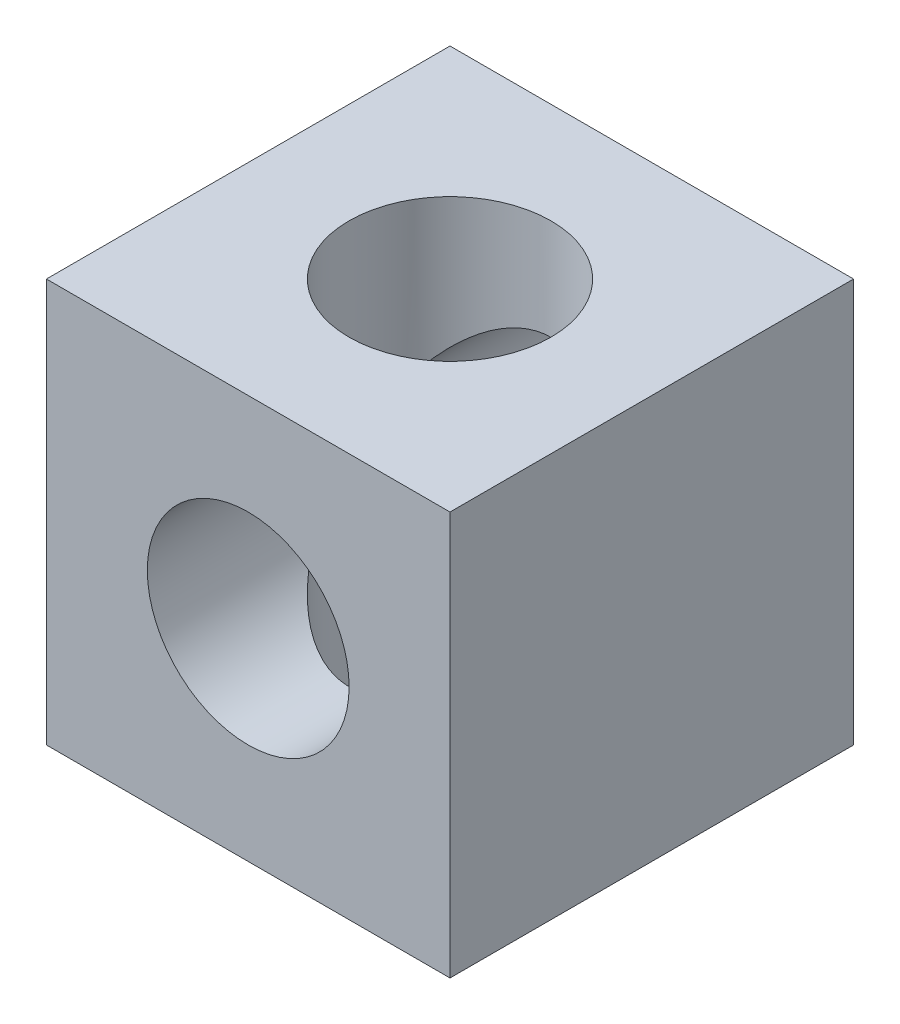
ISO-10303-21;
HEADER;
FILE_DESCRIPTION(('STEP AP214'),'2;1');
FILE_NAME('part.step','',(''),(''),'','','');
FILE_SCHEMA(('AUTOMOTIVE_DESIGN { 1 0 10303 214 1 1 1 1 }'));
ENDSEC;
DATA;
#1=APPLICATION_CONTEXT('core data for automotive mechanical design processes');
#2=APPLICATION_PROTOCOL_DEFINITION('international standard','automotive_design',2000,#1);
#3=PRODUCT_CONTEXT('',#1,'mechanical');
#4=PRODUCT('Part','Part','',(#3));
#5=PRODUCT_RELATED_PRODUCT_CATEGORY('part','',(#4));
#6=PRODUCT_DEFINITION_FORMATION('','',#4);
#7=PRODUCT_DEFINITION_CONTEXT('part definition',#1,'design');
#8=PRODUCT_DEFINITION('design','',#6,#7);
#9=PRODUCT_DEFINITION_SHAPE('','',#8);
#10=(LENGTH_UNIT() NAMED_UNIT(*) SI_UNIT(.MILLI.,.METRE.));
#11=(NAMED_UNIT(*) PLANE_ANGLE_UNIT() SI_UNIT($,.RADIAN.));
#12=(NAMED_UNIT(*) SI_UNIT($,.STERADIAN.) SOLID_ANGLE_UNIT());
#13=UNCERTAINTY_MEASURE_WITH_UNIT(LENGTH_MEASURE(1.E-05),#10,'distance_accuracy_value','');
#14=(GEOMETRIC_REPRESENTATION_CONTEXT(3) GLOBAL_UNCERTAINTY_ASSIGNED_CONTEXT((#13)) GLOBAL_UNIT_ASSIGNED_CONTEXT((#10,
#11,#12)) REPRESENTATION_CONTEXT('',''));
#15=CARTESIAN_POINT('',(0.,0.,0.));
#16=DIRECTION('',(0.,0.,1.));
#17=DIRECTION('',(1.,0.,0.));
#18=AXIS2_PLACEMENT_3D('',#15,#16,#17);
#19=CARTESIAN_POINT('',(9.5,-13.4350288425444,-9.5));
#20=DIRECTION('',(0.,1.,0.));
#21=DIRECTION('',(0.,0.,1.));
#22=AXIS2_PLACEMENT_3D('',#19,#20,#21);
#23=CYLINDRICAL_SURFACE('',#22,4.75);
#24=CARTESIAN_POINT('',(9.5,19.,-9.5));
#25=DIRECTION('',(0.,1.,0.));
#26=DIRECTION('',(0.,0.,1.));
#27=AXIS2_PLACEMENT_3D('',#24,#25,#26);
#28=CIRCLE('',#27,4.75);
#29=CARTESIAN_POINT('',(9.5,19.,-4.75));
#30=VERTEX_POINT('',#29);
#31=EDGE_CURVE('E127',#30,#30,#28,.T.);
#32=ORIENTED_EDGE('',*,*,#31,.T.);
#33=EDGE_LOOP('',(#32));
#34=FACE_BOUND('',#33,.T.);
#35=CARTESIAN_POINT('',(9.5,9.5,-9.5));
#36=DIRECTION('',(0.,0.707106781186547,-0.707106781186547));
#37=DIRECTION('',(0.,0.707106781186547,0.707106781186547));
#38=AXIS2_PLACEMENT_3D('',#35,#36,#37);
#39=ELLIPSE('',#38,6.7175144212722,4.75);
#40=CARTESIAN_POINT('',(14.25,9.5,-9.5));
#41=VERTEX_POINT('',#40);
#42=CARTESIAN_POINT('',(4.75,9.5,-9.5));
#43=VERTEX_POINT('',#42);
#44=EDGE_CURVE('E46',#41,#43,#39,.F.);
#45=ORIENTED_EDGE('',*,*,#44,.T.);
#46=CARTESIAN_POINT('',(9.5,9.5,-9.5));
#47=DIRECTION('',(0.,0.707106781186547,0.707106781186547));
#48=DIRECTION('',(0.,0.707106781186547,-0.707106781186547));
#49=AXIS2_PLACEMENT_3D('',#46,#47,#48);
#50=ELLIPSE('',#49,6.7175144212722,4.75);
#51=EDGE_CURVE('E11',#43,#41,#50,.F.);
#52=ORIENTED_EDGE('',*,*,#51,.T.);
#53=EDGE_LOOP('',(#45,#52));
#54=FACE_BOUND('',#53,.T.);
#55=ADVANCED_FACE('F33',(#34,#54),#23,.F.);
#56=CARTESIAN_POINT('',(0.,19.,0.));
#57=DIRECTION('',(1.,0.,0.));
#58=DIRECTION('',(0.,0.,-1.));
#59=AXIS2_PLACEMENT_3D('',#56,#57,#58);
#60=PLANE('',#59);
#61=DIRECTION('',(0.,0.,1.));
#62=VECTOR('',#61,1.);
#63=CARTESIAN_POINT('',(0.,0.,0.));
#64=LINE('',#63,#62);
#65=CARTESIAN_POINT('',(0.,0.,-19.));
#66=VERTEX_POINT('',#65);
#67=CARTESIAN_POINT('',(0.,0.,0.));
#68=VERTEX_POINT('',#67);
#69=EDGE_CURVE('E116',#66,#68,#64,.T.);
#70=ORIENTED_EDGE('',*,*,#69,.T.);
#71=DIRECTION('',(0.,-1.,0.));
#72=VECTOR('',#71,1.);
#73=CARTESIAN_POINT('',(0.,19.,0.));
#74=LINE('',#73,#72);
#75=CARTESIAN_POINT('',(0.,19.,0.));
#76=VERTEX_POINT('',#75);
#77=EDGE_CURVE('E97',#76,#68,#74,.T.);
#78=ORIENTED_EDGE('',*,*,#77,.F.);
#79=DIRECTION('',(0.,0.,1.));
#80=VECTOR('',#79,1.);
#81=CARTESIAN_POINT('',(0.,19.,0.));
#82=LINE('',#81,#80);
#83=CARTESIAN_POINT('',(0.,19.,-19.));
#84=VERTEX_POINT('',#83);
#85=EDGE_CURVE('E111',#84,#76,#82,.T.);
#86=ORIENTED_EDGE('',*,*,#85,.F.);
#87=DIRECTION('',(0.,-1.,0.));
#88=VECTOR('',#87,1.);
#89=CARTESIAN_POINT('',(0.,19.,-19.));
#90=LINE('',#89,#88);
#91=EDGE_CURVE('E108',#84,#66,#90,.T.);
#92=ORIENTED_EDGE('',*,*,#91,.T.);
#93=EDGE_LOOP('',(#70,#78,#86,#92));
#94=FACE_BOUND('',#93,.T.);
#95=ADVANCED_FACE('F35',(#94),#60,.F.);
#96=CARTESIAN_POINT('',(0.,19.,0.));
#97=DIRECTION('',(0.,0.,-1.));
#98=DIRECTION('',(-1.,0.,0.));
#99=AXIS2_PLACEMENT_3D('',#96,#97,#98);
#100=PLANE('',#99);
#101=CARTESIAN_POINT('',(9.5,9.5,0.));
#102=DIRECTION('',(0.,0.,1.));
#103=DIRECTION('',(1.,0.,0.));
#104=AXIS2_PLACEMENT_3D('',#101,#102,#103);
#105=CIRCLE('',#104,4.75);
#106=CARTESIAN_POINT('',(14.25,9.5,0.));
#107=VERTEX_POINT('',#106);
#108=EDGE_CURVE('E131',#107,#107,#105,.T.);
#109=ORIENTED_EDGE('',*,*,#108,.F.);
#110=EDGE_LOOP('',(#109));
#111=FACE_BOUND('',#110,.T.);
#112=DIRECTION('',(1.,0.,0.));
#113=VECTOR('',#112,1.);
#114=CARTESIAN_POINT('',(0.,0.,0.));
#115=LINE('',#114,#113);
#116=CARTESIAN_POINT('',(19.,0.,0.));
#117=VERTEX_POINT('',#116);
#118=EDGE_CURVE('E114',#68,#117,#115,.T.);
#119=ORIENTED_EDGE('',*,*,#118,.T.);
#120=DIRECTION('',(0.,-1.,0.));
#121=VECTOR('',#120,1.);
#122=CARTESIAN_POINT('',(19.,19.,0.));
#123=LINE('',#122,#121);
#124=CARTESIAN_POINT('',(19.,19.,0.));
#125=VERTEX_POINT('',#124);
#126=EDGE_CURVE('E103',#125,#117,#123,.T.);
#127=ORIENTED_EDGE('',*,*,#126,.F.);
#128=DIRECTION('',(1.,0.,0.));
#129=VECTOR('',#128,1.);
#130=CARTESIAN_POINT('',(0.,19.,0.));
#131=LINE('',#130,#129);
#132=EDGE_CURVE('E84',#76,#125,#131,.T.);
#133=ORIENTED_EDGE('',*,*,#132,.F.);
#134=ORIENTED_EDGE('',*,*,#77,.T.);
#135=EDGE_LOOP('',(#119,#127,#133,#134));
#136=FACE_BOUND('',#135,.T.);
#137=ADVANCED_FACE('F151',(#111,#136),#100,.F.);
#138=CARTESIAN_POINT('',(19.,19.,0.));
#139=DIRECTION('',(-1.,0.,0.));
#140=DIRECTION('',(0.,0.,1.));
#141=AXIS2_PLACEMENT_3D('',#138,#139,#140);
#142=PLANE('',#141);
#143=DIRECTION('',(0.,0.,-1.));
#144=VECTOR('',#143,1.);
#145=CARTESIAN_POINT('',(19.,0.,0.));
#146=LINE('',#145,#144);
#147=CARTESIAN_POINT('',(19.,0.,-19.));
#148=VERTEX_POINT('',#147);
#149=EDGE_CURVE('E112',#117,#148,#146,.T.);
#150=ORIENTED_EDGE('',*,*,#149,.T.);
#151=DIRECTION('',(0.,-1.,0.));
#152=VECTOR('',#151,1.);
#153=CARTESIAN_POINT('',(19.,19.,-19.));
#154=LINE('',#153,#152);
#155=CARTESIAN_POINT('',(19.,19.,-19.));
#156=VERTEX_POINT('',#155);
#157=EDGE_CURVE('E106',#156,#148,#154,.T.);
#158=ORIENTED_EDGE('',*,*,#157,.F.);
#159=DIRECTION('',(0.,0.,-1.));
#160=VECTOR('',#159,1.);
#161=CARTESIAN_POINT('',(19.,19.,0.));
#162=LINE('',#161,#160);
#163=EDGE_CURVE('E121',#125,#156,#162,.T.);
#164=ORIENTED_EDGE('',*,*,#163,.F.);
#165=ORIENTED_EDGE('',*,*,#126,.T.);
#166=EDGE_LOOP('',(#150,#158,#164,#165));
#167=FACE_BOUND('',#166,.T.);
#168=ADVANCED_FACE('F170',(#167),#142,.F.);
#169=CARTESIAN_POINT('',(0.,19.,-19.));
#170=DIRECTION('',(0.,0.,1.));
#171=DIRECTION('',(1.,0.,0.));
#172=AXIS2_PLACEMENT_3D('',#169,#170,#171);
#173=PLANE('',#172);
#174=CARTESIAN_POINT('',(9.5,9.5,-19.));
#175=DIRECTION('',(0.,0.,1.));
#176=DIRECTION('',(1.,0.,0.));
#177=AXIS2_PLACEMENT_3D('',#174,#175,#176);
#178=CIRCLE('',#177,4.75);
#179=CARTESIAN_POINT('',(14.25,9.5,-19.));
#180=VERTEX_POINT('',#179);
#181=EDGE_CURVE('E130',#180,#180,#178,.T.);
#182=ORIENTED_EDGE('',*,*,#181,.T.);
#183=EDGE_LOOP('',(#182));
#184=FACE_BOUND('',#183,.T.);
#185=DIRECTION('',(-1.,0.,0.));
#186=VECTOR('',#185,1.);
#187=CARTESIAN_POINT('',(0.,0.,-19.));
#188=LINE('',#187,#186);
#189=EDGE_CURVE('E76',#148,#66,#188,.T.);
#190=ORIENTED_EDGE('',*,*,#189,.T.);
#191=ORIENTED_EDGE('',*,*,#91,.F.);
#192=DIRECTION('',(-1.,0.,0.));
#193=VECTOR('',#192,1.);
#194=CARTESIAN_POINT('',(0.,19.,-19.));
#195=LINE('',#194,#193);
#196=EDGE_CURVE('E55',#156,#84,#195,.T.);
#197=ORIENTED_EDGE('',*,*,#196,.F.);
#198=ORIENTED_EDGE('',*,*,#157,.T.);
#199=EDGE_LOOP('',(#190,#191,#197,#198));
#200=FACE_BOUND('',#199,.T.);
#201=ADVANCED_FACE('F137',(#184,#200),#173,.F.);
#202=CARTESIAN_POINT('',(0.,19.,0.));
#203=DIRECTION('',(0.,-1.,0.));
#204=DIRECTION('',(0.,0.,-1.));
#205=AXIS2_PLACEMENT_3D('',#202,#203,#204);
#206=PLANE('',#205);
#207=ORIENTED_EDGE('',*,*,#31,.F.);
#208=EDGE_LOOP('',(#207));
#209=FACE_BOUND('',#208,.T.);
#210=ORIENTED_EDGE('',*,*,#85,.T.);
#211=ORIENTED_EDGE('',*,*,#132,.T.);
#212=ORIENTED_EDGE('',*,*,#163,.T.);
#213=ORIENTED_EDGE('',*,*,#196,.T.);
#214=EDGE_LOOP('',(#210,#211,#212,#213));
#215=FACE_BOUND('',#214,.T.);
#216=ADVANCED_FACE('F159',(#209,#215),#206,.F.);
#217=CARTESIAN_POINT('',(0.,0.,0.));
#218=DIRECTION('',(0.,-1.,0.));
#219=DIRECTION('',(0.,0.,-1.));
#220=AXIS2_PLACEMENT_3D('',#217,#218,#219);
#221=PLANE('',#220);
#222=CARTESIAN_POINT('',(9.5,0.,-9.5));
#223=DIRECTION('',(0.,-1.,0.));
#224=DIRECTION('',(0.,0.,-1.));
#225=AXIS2_PLACEMENT_3D('',#222,#223,#224);
#226=CIRCLE('',#225,4.75);
#227=CARTESIAN_POINT('',(9.5,0.,-14.25));
#228=VERTEX_POINT('',#227);
#229=EDGE_CURVE('E119',#228,#228,#226,.F.);
#230=ORIENTED_EDGE('',*,*,#229,.T.);
#231=EDGE_LOOP('',(#230));
#232=FACE_BOUND('',#231,.T.);
#233=ORIENTED_EDGE('',*,*,#69,.F.);
#234=ORIENTED_EDGE('',*,*,#189,.F.);
#235=ORIENTED_EDGE('',*,*,#149,.F.);
#236=ORIENTED_EDGE('',*,*,#118,.F.);
#237=EDGE_LOOP('',(#233,#234,#235,#236));
#238=FACE_BOUND('',#237,.T.);
#239=ADVANCED_FACE('F155',(#232,#238),#221,.T.);
#240=CARTESIAN_POINT('',(9.5,9.5,-9.5));
#241=DIRECTION('',(0.,0.707106781186547,-0.707106781186547));
#242=DIRECTION('',(0.,0.707106781186547,0.707106781186547));
#243=AXIS2_PLACEMENT_3D('',#240,#241,#242);
#244=ELLIPSE('',#243,6.7175144212722,4.75);
#245=EDGE_CURVE('E90',#41,#43,#244,.T.);
#246=ORIENTED_EDGE('',*,*,#245,.T.);
#247=CARTESIAN_POINT('',(9.5,9.5,-9.5));
#248=DIRECTION('',(0.,0.707106781186547,0.707106781186547));
#249=DIRECTION('',(0.,0.707106781186547,-0.707106781186547));
#250=AXIS2_PLACEMENT_3D('',#247,#248,#249);
#251=ELLIPSE('',#250,6.7175144212722,4.75);
#252=EDGE_CURVE('E41',#43,#41,#251,.T.);
#253=ORIENTED_EDGE('',*,*,#252,.T.);
#254=EDGE_LOOP('',(#246,#253));
#255=FACE_BOUND('',#254,.T.);
#256=ORIENTED_EDGE('',*,*,#229,.F.);
#257=EDGE_LOOP('',(#256));
#258=FACE_BOUND('',#257,.T.);
#259=ADVANCED_FACE('F99',(#255,#258),#23,.F.);
#260=CARTESIAN_POINT('',(9.5,9.5,-19.));
#261=DIRECTION('',(0.,0.,1.));
#262=DIRECTION('',(1.,0.,0.));
#263=AXIS2_PLACEMENT_3D('',#260,#261,#262);
#264=CYLINDRICAL_SURFACE('',#263,4.75);
#265=ORIENTED_EDGE('',*,*,#108,.T.);
#266=EDGE_LOOP('',(#265));
#267=FACE_BOUND('',#266,.T.);
#268=ORIENTED_EDGE('',*,*,#44,.F.);
#269=ORIENTED_EDGE('',*,*,#252,.F.);
#270=EDGE_LOOP('',(#268,#269));
#271=FACE_BOUND('',#270,.T.);
#272=ADVANCED_FACE('F96',(#267,#271),#264,.F.);
#273=ORIENTED_EDGE('',*,*,#181,.F.);
#274=EDGE_LOOP('',(#273));
#275=FACE_BOUND('',#274,.T.);
#276=ORIENTED_EDGE('',*,*,#245,.F.);
#277=ORIENTED_EDGE('',*,*,#51,.F.);
#278=EDGE_LOOP('',(#276,#277));
#279=FACE_BOUND('',#278,.T.);
#280=ADVANCED_FACE('F91',(#275,#279),#264,.F.);
#281=CLOSED_SHELL('',(#55,#95,#137,#168,#201,#216,#239,#259,#272,#280));
#282=MANIFOLD_SOLID_BREP('B2',#281);
#283=ADVANCED_BREP_SHAPE_REPRESENTATION('',(#18,#282),#14);
#284=SHAPE_DEFINITION_REPRESENTATION(#9,#283);
ENDSEC;
END-ISO-10303-21;
